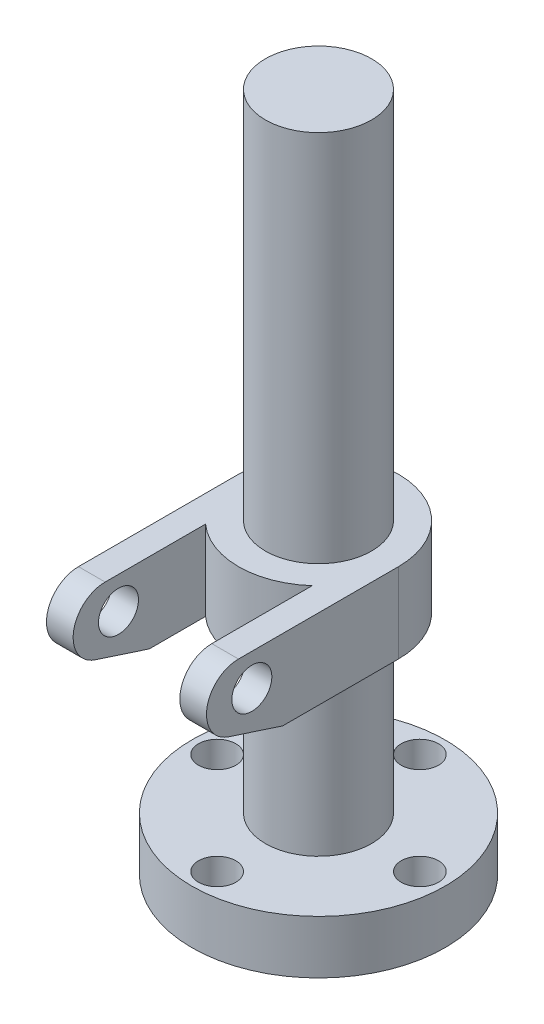
ISO-10303-21;
HEADER;
FILE_DESCRIPTION(('STEP AP214'),'2;1');
FILE_NAME('part.step','',(''),(''),'','','');
FILE_SCHEMA(('AUTOMOTIVE_DESIGN { 1 0 10303 214 1 1 1 1 }'));
ENDSEC;
DATA;
#1=APPLICATION_CONTEXT('core data for automotive mechanical design processes');
#2=APPLICATION_PROTOCOL_DEFINITION('international standard','automotive_design',2000,#1);
#3=PRODUCT_CONTEXT('',#1,'mechanical');
#4=PRODUCT('Part','Part','',(#3));
#5=PRODUCT_RELATED_PRODUCT_CATEGORY('part','',(#4));
#6=PRODUCT_DEFINITION_FORMATION('','',#4);
#7=PRODUCT_DEFINITION_CONTEXT('part definition',#1,'design');
#8=PRODUCT_DEFINITION('design','',#6,#7);
#9=PRODUCT_DEFINITION_SHAPE('','',#8);
#10=(LENGTH_UNIT() NAMED_UNIT(*) SI_UNIT(.MILLI.,.METRE.));
#11=(NAMED_UNIT(*) PLANE_ANGLE_UNIT() SI_UNIT($,.RADIAN.));
#12=(NAMED_UNIT(*) SI_UNIT($,.STERADIAN.) SOLID_ANGLE_UNIT());
#13=UNCERTAINTY_MEASURE_WITH_UNIT(LENGTH_MEASURE(1.E-05),#10,'distance_accuracy_value','');
#14=(GEOMETRIC_REPRESENTATION_CONTEXT(3) GLOBAL_UNCERTAINTY_ASSIGNED_CONTEXT((#13)) GLOBAL_UNIT_ASSIGNED_CONTEXT((#10,
#11,#12)) REPRESENTATION_CONTEXT('',''));
#15=CARTESIAN_POINT('',(0.,0.,0.));
#16=DIRECTION('',(0.,0.,1.));
#17=DIRECTION('',(1.,0.,0.));
#18=AXIS2_PLACEMENT_3D('',#15,#16,#17);
#19=CARTESIAN_POINT('',(0.,307.026159995937,0.));
#20=DIRECTION('',(0.,1.,0.));
#21=DIRECTION('',(0.,0.,1.));
#22=AXIS2_PLACEMENT_3D('',#19,#20,#21);
#23=CYLINDRICAL_SURFACE('',#22,30.);
#24=DIRECTION('',(0.,1.,0.));
#25=VECTOR('',#24,1.);
#26=CARTESIAN_POINT('',(20.,307.026159995937,22.3606797749979));
#27=LINE('',#26,#25);
#28=CARTESIAN_POINT('',(20.,115.,22.3606797749979));
#29=VERTEX_POINT('',#28);
#30=CARTESIAN_POINT('',(20.,85.,22.3606797749979));
#31=VERTEX_POINT('',#30);
#32=EDGE_CURVE('E148',#29,#31,#27,.F.);
#33=ORIENTED_EDGE('',*,*,#32,.F.);
#34=CARTESIAN_POINT('',(0.,115.,0.));
#35=DIRECTION('',(0.,1.,0.));
#36=DIRECTION('',(0.,0.,1.));
#37=AXIS2_PLACEMENT_3D('',#34,#35,#36);
#38=CIRCLE('',#37,30.);
#39=CARTESIAN_POINT('',(-20.,115.,22.3606797749979));
#40=VERTEX_POINT('',#39);
#41=EDGE_CURVE('E160',#40,#29,#38,.T.);
#42=ORIENTED_EDGE('',*,*,#41,.F.);
#43=DIRECTION('',(0.,1.,0.));
#44=VECTOR('',#43,1.);
#45=CARTESIAN_POINT('',(-20.,307.026159995937,22.3606797749979));
#46=LINE('',#45,#44);
#47=CARTESIAN_POINT('',(-20.,85.,22.3606797749979));
#48=VERTEX_POINT('',#47);
#49=EDGE_CURVE('E138',#48,#40,#46,.T.);
#50=ORIENTED_EDGE('',*,*,#49,.F.);
#51=CARTESIAN_POINT('',(0.,85.,0.));
#52=DIRECTION('',(0.,1.,0.));
#53=DIRECTION('',(0.,0.,1.));
#54=AXIS2_PLACEMENT_3D('',#51,#52,#53);
#55=CIRCLE('',#54,30.);
#56=EDGE_CURVE('E164',#48,#31,#55,.T.);
#57=ORIENTED_EDGE('',*,*,#56,.T.);
#58=EDGE_LOOP('',(#33,#42,#50,#57));
#59=FACE_BOUND('',#58,.T.);
#60=ADVANCED_FACE('F36',(#59),#23,.T.);
#61=DIRECTION('',(0.,-1.,0.));
#62=VECTOR('',#61,1.);
#63=CARTESIAN_POINT('',(30.,195.622577482985,0.));
#64=LINE('',#63,#62);
#65=CARTESIAN_POINT('',(30.,115.,0.));
#66=VERTEX_POINT('',#65);
#67=CARTESIAN_POINT('',(30.,85.,0.));
#68=VERTEX_POINT('',#67);
#69=EDGE_CURVE('E199',#66,#68,#64,.T.);
#70=ORIENTED_EDGE('',*,*,#69,.T.);
#71=CARTESIAN_POINT('',(-30.,85.,0.));
#72=VERTEX_POINT('',#71);
#73=EDGE_CURVE('E163',#68,#72,#55,.T.);
#74=ORIENTED_EDGE('',*,*,#73,.T.);
#75=DIRECTION('',(0.,-1.,0.));
#76=VECTOR('',#75,1.);
#77=CARTESIAN_POINT('',(-30.,195.622577482985,0.));
#78=LINE('',#77,#76);
#79=CARTESIAN_POINT('',(-30.,115.,0.));
#80=VERTEX_POINT('',#79);
#81=EDGE_CURVE('E144',#80,#72,#78,.T.);
#82=ORIENTED_EDGE('',*,*,#81,.F.);
#83=EDGE_CURVE('E136',#66,#80,#38,.T.);
#84=ORIENTED_EDGE('',*,*,#83,.F.);
#85=EDGE_LOOP('',(#70,#74,#82,#84));
#86=FACE_BOUND('',#85,.T.);
#87=ADVANCED_FACE('F323',(#86),#23,.T.);
#88=CARTESIAN_POINT('',(19.9,255.,0.));
#89=DIRECTION('',(0.,-1.,0.));
#90=DIRECTION('',(0.,0.,-1.));
#91=AXIS2_PLACEMENT_3D('',#88,#89,#90);
#92=PLANE('',#91);
#93=CARTESIAN_POINT('',(0.,255.,0.));
#94=DIRECTION('',(0.,1.,0.));
#95=DIRECTION('',(0.,0.,1.));
#96=AXIS2_PLACEMENT_3D('',#93,#94,#95);
#97=CIRCLE('',#96,19.9);
#98=CARTESIAN_POINT('',(0.,255.,19.9));
#99=VERTEX_POINT('',#98);
#100=EDGE_CURVE('E142',#99,#99,#97,.T.);
#101=ORIENTED_EDGE('',*,*,#100,.T.);
#102=EDGE_LOOP('',(#101));
#103=FACE_BOUND('',#102,.T.);
#104=ADVANCED_FACE('F38',(#103),#92,.F.);
#105=CARTESIAN_POINT('',(0.,0.,0.));
#106=DIRECTION('',(0.,1.,0.));
#107=DIRECTION('',(0.,0.,1.));
#108=AXIS2_PLACEMENT_3D('',#105,#106,#107);
#109=PLANE('',#108);
#110=CARTESIAN_POINT('',(0.,0.,0.));
#111=DIRECTION('',(0.,-1.,0.));
#112=DIRECTION('',(0.,0.,-1.));
#113=AXIS2_PLACEMENT_3D('',#110,#111,#112);
#114=CIRCLE('',#113,20.);
#115=CARTESIAN_POINT('',(0.,0.,-20.));
#116=VERTEX_POINT('',#115);
#117=EDGE_CURVE('E282',#116,#116,#114,.T.);
#118=ORIENTED_EDGE('',*,*,#117,.F.);
#119=EDGE_LOOP('',(#118));
#120=FACE_BOUND('',#119,.T.);
#121=CARTESIAN_POINT('',(38.,0.,0.));
#122=DIRECTION('',(0.,1.,0.));
#123=DIRECTION('',(0.,0.,1.));
#124=AXIS2_PLACEMENT_3D('',#121,#122,#123);
#125=CIRCLE('',#124,5.00000000000001);
#126=CARTESIAN_POINT('',(38.,0.,5.00000000000001));
#127=VERTEX_POINT('',#126);
#128=EDGE_CURVE('E269',#127,#127,#125,.T.);
#129=ORIENTED_EDGE('',*,*,#128,.T.);
#130=EDGE_LOOP('',(#129));
#131=FACE_BOUND('',#130,.T.);
#132=CARTESIAN_POINT('',(0.,0.,-38.));
#133=DIRECTION('',(0.,1.,0.));
#134=DIRECTION('',(0.,0.,1.));
#135=AXIS2_PLACEMENT_3D('',#132,#133,#134);
#136=CIRCLE('',#135,5.00000000000001);
#137=CARTESIAN_POINT('',(0.,0.,-33.));
#138=VERTEX_POINT('',#137);
#139=EDGE_CURVE('E257',#138,#138,#136,.T.);
#140=ORIENTED_EDGE('',*,*,#139,.T.);
#141=EDGE_LOOP('',(#140));
#142=FACE_BOUND('',#141,.T.);
#143=CARTESIAN_POINT('',(-38.,0.,0.));
#144=DIRECTION('',(0.,1.,0.));
#145=DIRECTION('',(0.,0.,1.));
#146=AXIS2_PLACEMENT_3D('',#143,#144,#145);
#147=CIRCLE('',#146,5.00000000000001);
#148=CARTESIAN_POINT('',(-38.,0.,5.00000000000001));
#149=VERTEX_POINT('',#148);
#150=EDGE_CURVE('E245',#149,#149,#147,.T.);
#151=ORIENTED_EDGE('',*,*,#150,.T.);
#152=EDGE_LOOP('',(#151));
#153=FACE_BOUND('',#152,.T.);
#154=CARTESIAN_POINT('',(0.,0.,38.));
#155=DIRECTION('',(0.,1.,0.));
#156=DIRECTION('',(0.,0.,1.));
#157=AXIS2_PLACEMENT_3D('',#154,#155,#156);
#158=CIRCLE('',#157,5.00000000000001);
#159=CARTESIAN_POINT('',(0.,0.,43.));
#160=VERTEX_POINT('',#159);
#161=EDGE_CURVE('E120',#160,#160,#158,.T.);
#162=ORIENTED_EDGE('',*,*,#161,.T.);
#163=EDGE_LOOP('',(#162));
#164=FACE_BOUND('',#163,.T.);
#165=CARTESIAN_POINT('',(0.,0.,0.));
#166=DIRECTION('',(0.,1.,0.));
#167=DIRECTION('',(0.,0.,1.));
#168=AXIS2_PLACEMENT_3D('',#165,#166,#167);
#169=CIRCLE('',#168,47.5);
#170=CARTESIAN_POINT('',(0.,0.,47.5));
#171=VERTEX_POINT('',#170);
#172=EDGE_CURVE('E176',#171,#171,#169,.T.);
#173=ORIENTED_EDGE('',*,*,#172,.F.);
#174=EDGE_LOOP('',(#173));
#175=FACE_BOUND('',#174,.T.);
#176=ADVANCED_FACE('F297',(#120,#131,#142,#153,#164,#175),#109,.F.);
#177=CARTESIAN_POINT('',(0.,307.026159995937,0.));
#178=DIRECTION('',(0.,1.,0.));
#179=DIRECTION('',(0.,0.,1.));
#180=AXIS2_PLACEMENT_3D('',#177,#178,#179);
#181=CYLINDRICAL_SURFACE('',#180,47.5);
#182=CARTESIAN_POINT('',(0.,20.,0.));
#183=DIRECTION('',(0.,1.,0.));
#184=DIRECTION('',(0.,0.,1.));
#185=AXIS2_PLACEMENT_3D('',#182,#183,#184);
#186=CIRCLE('',#185,47.5);
#187=CARTESIAN_POINT('',(0.,20.,47.5));
#188=VERTEX_POINT('',#187);
#189=EDGE_CURVE('E173',#188,#188,#186,.T.);
#190=ORIENTED_EDGE('',*,*,#189,.F.);
#191=EDGE_LOOP('',(#190));
#192=FACE_BOUND('',#191,.T.);
#193=ORIENTED_EDGE('',*,*,#172,.T.);
#194=EDGE_LOOP('',(#193));
#195=FACE_BOUND('',#194,.T.);
#196=ADVANCED_FACE('F300',(#192,#195),#181,.T.);
#197=CARTESIAN_POINT('',(47.5,20.,0.));
#198=DIRECTION('',(0.,-1.,0.));
#199=DIRECTION('',(0.,0.,-1.));
#200=AXIS2_PLACEMENT_3D('',#197,#198,#199);
#201=PLANE('',#200);
#202=CARTESIAN_POINT('',(38.,20.,0.));
#203=DIRECTION('',(0.,1.,0.));
#204=DIRECTION('',(0.,0.,1.));
#205=AXIS2_PLACEMENT_3D('',#202,#203,#204);
#206=CIRCLE('',#205,7.00000000000001);
#207=CARTESIAN_POINT('',(38.,20.,7.00000000000001));
#208=VERTEX_POINT('',#207);
#209=EDGE_CURVE('E278',#208,#208,#206,.T.);
#210=ORIENTED_EDGE('',*,*,#209,.F.);
#211=EDGE_LOOP('',(#210));
#212=FACE_BOUND('',#211,.T.);
#213=CARTESIAN_POINT('',(0.,20.,-38.));
#214=DIRECTION('',(0.,1.,0.));
#215=DIRECTION('',(0.,0.,1.));
#216=AXIS2_PLACEMENT_3D('',#213,#214,#215);
#217=CIRCLE('',#216,7.00000000000001);
#218=CARTESIAN_POINT('',(0.,20.,-31.));
#219=VERTEX_POINT('',#218);
#220=EDGE_CURVE('E266',#219,#219,#217,.T.);
#221=ORIENTED_EDGE('',*,*,#220,.F.);
#222=EDGE_LOOP('',(#221));
#223=FACE_BOUND('',#222,.T.);
#224=CARTESIAN_POINT('',(-38.,20.,0.));
#225=DIRECTION('',(0.,1.,0.));
#226=DIRECTION('',(0.,0.,1.));
#227=AXIS2_PLACEMENT_3D('',#224,#225,#226);
#228=CIRCLE('',#227,7.00000000000001);
#229=CARTESIAN_POINT('',(-38.,20.,7.00000000000001));
#230=VERTEX_POINT('',#229);
#231=EDGE_CURVE('E254',#230,#230,#228,.T.);
#232=ORIENTED_EDGE('',*,*,#231,.F.);
#233=EDGE_LOOP('',(#232));
#234=FACE_BOUND('',#233,.T.);
#235=CARTESIAN_POINT('',(0.,20.,38.));
#236=DIRECTION('',(0.,1.,0.));
#237=DIRECTION('',(0.,0.,1.));
#238=AXIS2_PLACEMENT_3D('',#235,#236,#237);
#239=CIRCLE('',#238,7.00000000000001);
#240=CARTESIAN_POINT('',(0.,20.,45.));
#241=VERTEX_POINT('',#240);
#242=EDGE_CURVE('E242',#241,#241,#239,.T.);
#243=ORIENTED_EDGE('',*,*,#242,.F.);
#244=EDGE_LOOP('',(#243));
#245=FACE_BOUND('',#244,.T.);
#246=CARTESIAN_POINT('',(0.,20.,0.));
#247=DIRECTION('',(0.,1.,0.));
#248=DIRECTION('',(0.,0.,1.));
#249=AXIS2_PLACEMENT_3D('',#246,#247,#248);
#250=CIRCLE('',#249,19.9);
#251=CARTESIAN_POINT('',(0.,20.,19.9));
#252=VERTEX_POINT('',#251);
#253=EDGE_CURVE('E170',#252,#252,#250,.T.);
#254=ORIENTED_EDGE('',*,*,#253,.F.);
#255=EDGE_LOOP('',(#254));
#256=FACE_BOUND('',#255,.T.);
#257=ORIENTED_EDGE('',*,*,#189,.T.);
#258=EDGE_LOOP('',(#257));
#259=FACE_BOUND('',#258,.T.);
#260=ADVANCED_FACE('F312',(#212,#223,#234,#245,#256,#259),#201,.F.);
#261=CARTESIAN_POINT('',(0.,307.026159995937,0.));
#262=DIRECTION('',(0.,1.,0.));
#263=DIRECTION('',(0.,0.,1.));
#264=AXIS2_PLACEMENT_3D('',#261,#262,#263);
#265=CYLINDRICAL_SURFACE('',#264,19.9);
#266=CARTESIAN_POINT('',(0.,85.,0.));
#267=DIRECTION('',(0.,1.,0.));
#268=DIRECTION('',(0.,0.,1.));
#269=AXIS2_PLACEMENT_3D('',#266,#267,#268);
#270=CIRCLE('',#269,19.9);
#271=CARTESIAN_POINT('',(0.,85.,19.9));
#272=VERTEX_POINT('',#271);
#273=EDGE_CURVE('E167',#272,#272,#270,.T.);
#274=ORIENTED_EDGE('',*,*,#273,.F.);
#275=EDGE_LOOP('',(#274));
#276=FACE_BOUND('',#275,.T.);
#277=ORIENTED_EDGE('',*,*,#253,.T.);
#278=EDGE_LOOP('',(#277));
#279=FACE_BOUND('',#278,.T.);
#280=ADVANCED_FACE('F318',(#276,#279),#265,.T.);
#281=CARTESIAN_POINT('',(19.9,85.,0.));
#282=DIRECTION('',(0.,1.,0.));
#283=DIRECTION('',(0.,0.,1.));
#284=AXIS2_PLACEMENT_3D('',#281,#282,#283);
#285=PLANE('',#284);
#286=DIRECTION('',(0.,0.,-1.));
#287=VECTOR('',#286,1.);
#288=CARTESIAN_POINT('',(30.,85.,0.));
#289=LINE('',#288,#287);
#290=CARTESIAN_POINT('',(30.,85.,43.4422205699365));
#291=VERTEX_POINT('',#290);
#292=EDGE_CURVE('E186',#291,#68,#289,.T.);
#293=ORIENTED_EDGE('',*,*,#292,.F.);
#294=DIRECTION('',(-1.,0.,0.));
#295=VECTOR('',#294,1.);
#296=CARTESIAN_POINT('',(64.,85.,43.4422205699367));
#297=LINE('',#296,#295);
#298=CARTESIAN_POINT('',(20.,85.,43.4422205699367));
#299=VERTEX_POINT('',#298);
#300=EDGE_CURVE('E59',#291,#299,#297,.T.);
#301=ORIENTED_EDGE('',*,*,#300,.T.);
#302=DIRECTION('',(0.,0.,1.));
#303=VECTOR('',#302,1.);
#304=CARTESIAN_POINT('',(20.,85.,80.));
#305=LINE('',#304,#303);
#306=EDGE_CURVE('E197',#31,#299,#305,.T.);
#307=ORIENTED_EDGE('',*,*,#306,.F.);
#308=ORIENTED_EDGE('',*,*,#56,.F.);
#309=DIRECTION('',(0.,0.,-1.));
#310=VECTOR('',#309,1.);
#311=CARTESIAN_POINT('',(-20.,85.,80.));
#312=LINE('',#311,#310);
#313=CARTESIAN_POINT('',(-20.,85.,43.4422205699367));
#314=VERTEX_POINT('',#313);
#315=EDGE_CURVE('E152',#314,#48,#312,.T.);
#316=ORIENTED_EDGE('',*,*,#315,.F.);
#317=CARTESIAN_POINT('',(-30.,85.,43.4422205699367));
#318=VERTEX_POINT('',#317);
#319=EDGE_CURVE('E229',#314,#318,#297,.T.);
#320=ORIENTED_EDGE('',*,*,#319,.T.);
#321=DIRECTION('',(0.,0.,1.));
#322=VECTOR('',#321,1.);
#323=CARTESIAN_POINT('',(-30.,85.,0.));
#324=LINE('',#323,#322);
#325=EDGE_CURVE('E150',#72,#318,#324,.T.);
#326=ORIENTED_EDGE('',*,*,#325,.F.);
#327=ORIENTED_EDGE('',*,*,#73,.F.);
#328=EDGE_LOOP('',(#293,#301,#307,#308,#316,#320,#326,#327));
#329=FACE_BOUND('',#328,.T.);
#330=ORIENTED_EDGE('',*,*,#273,.T.);
#331=EDGE_LOOP('',(#330));
#332=FACE_BOUND('',#331,.T.);
#333=ADVANCED_FACE('F192',(#329,#332),#285,.F.);
#334=CARTESIAN_POINT('',(30.,115.,0.));
#335=DIRECTION('',(0.,-1.,0.));
#336=DIRECTION('',(0.,0.,-1.));
#337=AXIS2_PLACEMENT_3D('',#334,#335,#336);
#338=PLANE('',#337);
#339=DIRECTION('',(0.,0.,-1.));
#340=VECTOR('',#339,1.);
#341=CARTESIAN_POINT('',(-30.,115.,0.));
#342=LINE('',#341,#340);
#343=CARTESIAN_POINT('',(-30.,115.,60.));
#344=VERTEX_POINT('',#343);
#345=EDGE_CURVE('E126',#344,#80,#342,.T.);
#346=ORIENTED_EDGE('',*,*,#345,.F.);
#347=DIRECTION('',(-1.,0.,0.));
#348=VECTOR('',#347,1.);
#349=CARTESIAN_POINT('',(64.,115.,60.));
#350=LINE('',#349,#348);
#351=CARTESIAN_POINT('',(-20.,115.,60.));
#352=VERTEX_POINT('',#351);
#353=EDGE_CURVE('E112',#352,#344,#350,.T.);
#354=ORIENTED_EDGE('',*,*,#353,.F.);
#355=DIRECTION('',(0.,0.,1.));
#356=VECTOR('',#355,1.);
#357=CARTESIAN_POINT('',(-20.,115.,80.));
#358=LINE('',#357,#356);
#359=EDGE_CURVE('E139',#40,#352,#358,.T.);
#360=ORIENTED_EDGE('',*,*,#359,.F.);
#361=ORIENTED_EDGE('',*,*,#41,.T.);
#362=DIRECTION('',(0.,0.,-1.));
#363=VECTOR('',#362,1.);
#364=CARTESIAN_POINT('',(20.,115.,80.));
#365=LINE('',#364,#363);
#366=CARTESIAN_POINT('',(20.,115.,60.));
#367=VERTEX_POINT('',#366);
#368=EDGE_CURVE('E204',#367,#29,#365,.T.);
#369=ORIENTED_EDGE('',*,*,#368,.F.);
#370=CARTESIAN_POINT('',(30.,115.,60.));
#371=VERTEX_POINT('',#370);
#372=EDGE_CURVE('E119',#371,#367,#350,.T.);
#373=ORIENTED_EDGE('',*,*,#372,.F.);
#374=DIRECTION('',(0.,0.,1.));
#375=VECTOR('',#374,1.);
#376=CARTESIAN_POINT('',(30.,115.,0.));
#377=LINE('',#376,#375);
#378=EDGE_CURVE('E203',#66,#371,#377,.T.);
#379=ORIENTED_EDGE('',*,*,#378,.F.);
#380=ORIENTED_EDGE('',*,*,#83,.T.);
#381=EDGE_LOOP('',(#346,#354,#360,#361,#369,#373,#379,#380));
#382=FACE_BOUND('',#381,.T.);
#383=CARTESIAN_POINT('',(0.,115.,0.));
#384=DIRECTION('',(0.,1.,0.));
#385=DIRECTION('',(0.,0.,1.));
#386=AXIS2_PLACEMENT_3D('',#383,#384,#385);
#387=CIRCLE('',#386,19.9);
#388=CARTESIAN_POINT('',(0.,115.,19.9));
#389=VERTEX_POINT('',#388);
#390=EDGE_CURVE('E157',#389,#389,#387,.T.);
#391=ORIENTED_EDGE('',*,*,#390,.F.);
#392=EDGE_LOOP('',(#391));
#393=FACE_BOUND('',#392,.T.);
#394=ADVANCED_FACE('F132',(#382,#393),#338,.F.);
#395=CARTESIAN_POINT('',(0.,307.026159995937,0.));
#396=DIRECTION('',(0.,1.,0.));
#397=DIRECTION('',(0.,0.,1.));
#398=AXIS2_PLACEMENT_3D('',#395,#396,#397);
#399=CYLINDRICAL_SURFACE('',#398,19.9);
#400=ORIENTED_EDGE('',*,*,#100,.F.);
#401=EDGE_LOOP('',(#400));
#402=FACE_BOUND('',#401,.T.);
#403=ORIENTED_EDGE('',*,*,#390,.T.);
#404=EDGE_LOOP('',(#403));
#405=FACE_BOUND('',#404,.T.);
#406=ADVANCED_FACE('F357',(#402,#405),#399,.T.);
#407=CARTESIAN_POINT('',(-20.,195.622577482985,80.));
#408=DIRECTION('',(-1.,0.,0.));
#409=DIRECTION('',(0.,0.,1.));
#410=AXIS2_PLACEMENT_3D('',#407,#408,#409);
#411=PLANE('',#410);
#412=CARTESIAN_POINT('',(-20.,103.,55.));
#413=DIRECTION('',(-1.,0.,0.));
#414=DIRECTION('',(0.,0.,1.));
#415=AXIS2_PLACEMENT_3D('',#412,#413,#414);
#416=CIRCLE('',#415,7.5);
#417=CARTESIAN_POINT('',(-20.,103.,62.5));
#418=VERTEX_POINT('',#417);
#419=EDGE_CURVE('E220',#418,#418,#416,.T.);
#420=ORIENTED_EDGE('',*,*,#419,.T.);
#421=EDGE_LOOP('',(#420));
#422=FACE_BOUND('',#421,.T.);
#423=ORIENTED_EDGE('',*,*,#359,.T.);
#424=CARTESIAN_POINT('',(-20.,103.,60.));
#425=DIRECTION('',(-1.,0.,0.));
#426=DIRECTION('',(0.,0.,1.));
#427=AXIS2_PLACEMENT_3D('',#424,#425,#426);
#428=CIRCLE('',#427,12.);
#429=CARTESIAN_POINT('',(-20.,91.5877363767371,63.7094796121763));
#430=VERTEX_POINT('',#429);
#431=EDGE_CURVE('E115',#352,#430,#428,.F.);
#432=ORIENTED_EDGE('',*,*,#431,.T.);
#433=DIRECTION('',(0.,-0.309123301014688,-0.951021968605238));
#434=VECTOR('',#433,1.);
#435=CARTESIAN_POINT('',(-20.,106.318152953911,109.027803160143));
#436=LINE('',#435,#434);
#437=EDGE_CURVE('E214',#430,#314,#436,.T.);
#438=ORIENTED_EDGE('',*,*,#437,.T.);
#439=ORIENTED_EDGE('',*,*,#315,.T.);
#440=ORIENTED_EDGE('',*,*,#49,.T.);
#441=EDGE_LOOP('',(#423,#432,#438,#439,#440));
#442=FACE_BOUND('',#441,.T.);
#443=ADVANCED_FACE('F363',(#422,#442),#411,.F.);
#444=CARTESIAN_POINT('',(-30.,195.622577482985,0.));
#445=DIRECTION('',(1.,0.,0.));
#446=DIRECTION('',(0.,0.,-1.));
#447=AXIS2_PLACEMENT_3D('',#444,#445,#446);
#448=PLANE('',#447);
#449=CARTESIAN_POINT('',(-30.,103.,55.));
#450=DIRECTION('',(-1.,0.,0.));
#451=DIRECTION('',(0.,0.,1.));
#452=AXIS2_PLACEMENT_3D('',#449,#450,#451);
#453=CIRCLE('',#452,7.5);
#454=CARTESIAN_POINT('',(-30.,103.,62.5));
#455=VERTEX_POINT('',#454);
#456=EDGE_CURVE('E130',#455,#455,#453,.T.);
#457=ORIENTED_EDGE('',*,*,#456,.F.);
#458=EDGE_LOOP('',(#457));
#459=FACE_BOUND('',#458,.T.);
#460=DIRECTION('',(0.,-0.309123301014688,-0.951021968605238));
#461=VECTOR('',#460,1.);
#462=CARTESIAN_POINT('',(-30.,85.,43.4422205699367));
#463=LINE('',#462,#461);
#464=CARTESIAN_POINT('',(-30.,91.5877363767371,63.7094796121763));
#465=VERTEX_POINT('',#464);
#466=EDGE_CURVE('E129',#465,#318,#463,.T.);
#467=ORIENTED_EDGE('',*,*,#466,.F.);
#468=CARTESIAN_POINT('',(-30.,103.,60.));
#469=DIRECTION('',(1.,0.,0.));
#470=DIRECTION('',(0.,0.,1.));
#471=AXIS2_PLACEMENT_3D('',#468,#469,#470);
#472=CIRCLE('',#471,12.);
#473=EDGE_CURVE('E51',#344,#465,#472,.T.);
#474=ORIENTED_EDGE('',*,*,#473,.F.);
#475=ORIENTED_EDGE('',*,*,#345,.T.);
#476=ORIENTED_EDGE('',*,*,#81,.T.);
#477=ORIENTED_EDGE('',*,*,#325,.T.);
#478=EDGE_LOOP('',(#467,#474,#475,#476,#477));
#479=FACE_BOUND('',#478,.T.);
#480=ADVANCED_FACE('F124',(#459,#479),#448,.F.);
#481=CARTESIAN_POINT('',(20.,195.622577482985,80.));
#482=DIRECTION('',(1.,0.,0.));
#483=DIRECTION('',(0.,0.,-1.));
#484=AXIS2_PLACEMENT_3D('',#481,#482,#483);
#485=PLANE('',#484);
#486=CARTESIAN_POINT('',(20.,103.,55.));
#487=DIRECTION('',(1.,0.,0.));
#488=DIRECTION('',(0.,0.,-1.));
#489=AXIS2_PLACEMENT_3D('',#486,#487,#488);
#490=CIRCLE('',#489,7.5);
#491=CARTESIAN_POINT('',(20.,103.,47.5));
#492=VERTEX_POINT('',#491);
#493=EDGE_CURVE('E181',#492,#492,#490,.T.);
#494=ORIENTED_EDGE('',*,*,#493,.T.);
#495=EDGE_LOOP('',(#494));
#496=FACE_BOUND('',#495,.T.);
#497=DIRECTION('',(0.,0.309123301014688,0.951021968605238));
#498=VECTOR('',#497,1.);
#499=CARTESIAN_POINT('',(20.,106.318152953911,109.027803160143));
#500=LINE('',#499,#498);
#501=CARTESIAN_POINT('',(20.,91.5877363767371,63.7094796121762));
#502=VERTEX_POINT('',#501);
#503=EDGE_CURVE('E217',#299,#502,#500,.T.);
#504=ORIENTED_EDGE('',*,*,#503,.T.);
#505=CARTESIAN_POINT('',(20.,103.,60.));
#506=DIRECTION('',(1.,0.,0.));
#507=DIRECTION('',(0.,0.,-1.));
#508=AXIS2_PLACEMENT_3D('',#505,#506,#507);
#509=CIRCLE('',#508,12.);
#510=EDGE_CURVE('E212',#502,#367,#509,.F.);
#511=ORIENTED_EDGE('',*,*,#510,.T.);
#512=ORIENTED_EDGE('',*,*,#368,.T.);
#513=ORIENTED_EDGE('',*,*,#32,.T.);
#514=ORIENTED_EDGE('',*,*,#306,.T.);
#515=EDGE_LOOP('',(#504,#511,#512,#513,#514));
#516=FACE_BOUND('',#515,.T.);
#517=ADVANCED_FACE('F376',(#496,#516),#485,.F.);
#518=CARTESIAN_POINT('',(30.,195.622577482985,0.));
#519=DIRECTION('',(-1.,0.,0.));
#520=DIRECTION('',(0.,0.,1.));
#521=AXIS2_PLACEMENT_3D('',#518,#519,#520);
#522=PLANE('',#521);
#523=CARTESIAN_POINT('',(30.,103.,55.));
#524=DIRECTION('',(-1.,0.,0.));
#525=DIRECTION('',(0.,0.,1.));
#526=AXIS2_PLACEMENT_3D('',#523,#524,#525);
#527=CIRCLE('',#526,7.5);
#528=CARTESIAN_POINT('',(30.,103.,62.5));
#529=VERTEX_POINT('',#528);
#530=EDGE_CURVE('E179',#529,#529,#527,.T.);
#531=ORIENTED_EDGE('',*,*,#530,.T.);
#532=EDGE_LOOP('',(#531));
#533=FACE_BOUND('',#532,.T.);
#534=ORIENTED_EDGE('',*,*,#378,.T.);
#535=CARTESIAN_POINT('',(30.,103.,60.));
#536=DIRECTION('',(-1.,0.,0.));
#537=DIRECTION('',(0.,0.,1.));
#538=AXIS2_PLACEMENT_3D('',#535,#536,#537);
#539=CIRCLE('',#538,12.);
#540=CARTESIAN_POINT('',(30.,91.5877363767371,63.7094796121762));
#541=VERTEX_POINT('',#540);
#542=EDGE_CURVE('E11',#371,#541,#539,.F.);
#543=ORIENTED_EDGE('',*,*,#542,.T.);
#544=DIRECTION('',(0.,-0.309123301014688,-0.951021968605238));
#545=VECTOR('',#544,1.);
#546=CARTESIAN_POINT('',(30.,82.799508932092,36.6723803785605));
#547=LINE('',#546,#545);
#548=EDGE_CURVE('E44',#541,#291,#547,.T.);
#549=ORIENTED_EDGE('',*,*,#548,.T.);
#550=ORIENTED_EDGE('',*,*,#292,.T.);
#551=ORIENTED_EDGE('',*,*,#69,.F.);
#552=EDGE_LOOP('',(#534,#543,#549,#550,#551));
#553=FACE_BOUND('',#552,.T.);
#554=ADVANCED_FACE('F185',(#533,#553),#522,.F.);
#555=CARTESIAN_POINT('',(64.,103.,55.));
#556=DIRECTION('',(-1.,0.,0.));
#557=DIRECTION('',(0.,0.,1.));
#558=AXIS2_PLACEMENT_3D('',#555,#556,#557);
#559=CYLINDRICAL_SURFACE('',#558,7.5);
#560=ORIENTED_EDGE('',*,*,#530,.F.);
#561=EDGE_LOOP('',(#560));
#562=FACE_BOUND('',#561,.T.);
#563=ORIENTED_EDGE('',*,*,#493,.F.);
#564=EDGE_LOOP('',(#563));
#565=FACE_BOUND('',#564,.T.);
#566=ADVANCED_FACE('F391',(#562,#565),#559,.F.);
#567=CARTESIAN_POINT('',(64.,85.,43.4422205699367));
#568=DIRECTION('',(0.,0.951021968605238,-0.309123301014688));
#569=DIRECTION('',(0.,0.309123301014688,0.951021968605238));
#570=AXIS2_PLACEMENT_3D('',#567,#568,#569);
#571=PLANE('',#570);
#572=ORIENTED_EDGE('',*,*,#300,.F.);
#573=ORIENTED_EDGE('',*,*,#548,.F.);
#574=DIRECTION('',(-1.,0.,0.));
#575=VECTOR('',#574,1.);
#576=CARTESIAN_POINT('',(64.,91.5877363767371,63.7094796121762));
#577=LINE('',#576,#575);
#578=EDGE_CURVE('E227',#541,#502,#577,.T.);
#579=ORIENTED_EDGE('',*,*,#578,.T.);
#580=ORIENTED_EDGE('',*,*,#503,.F.);
#581=EDGE_LOOP('',(#572,#573,#579,#580));
#582=FACE_BOUND('',#581,.T.);
#583=ADVANCED_FACE('F399',(#582),#571,.F.);
#584=CARTESIAN_POINT('',(64.,103.,60.));
#585=DIRECTION('',(-1.,0.,0.));
#586=DIRECTION('',(0.,0.,1.));
#587=AXIS2_PLACEMENT_3D('',#584,#585,#586);
#588=CYLINDRICAL_SURFACE('',#587,12.);
#589=ORIENTED_EDGE('',*,*,#578,.F.);
#590=ORIENTED_EDGE('',*,*,#542,.F.);
#591=ORIENTED_EDGE('',*,*,#372,.T.);
#592=ORIENTED_EDGE('',*,*,#510,.F.);
#593=EDGE_LOOP('',(#589,#590,#591,#592));
#594=FACE_BOUND('',#593,.T.);
#595=ADVANCED_FACE('F408',(#594),#588,.T.);
#596=ORIENTED_EDGE('',*,*,#456,.T.);
#597=EDGE_LOOP('',(#596));
#598=FACE_BOUND('',#597,.T.);
#599=ORIENTED_EDGE('',*,*,#419,.F.);
#600=EDGE_LOOP('',(#599));
#601=FACE_BOUND('',#600,.T.);
#602=ADVANCED_FACE('F402',(#598,#601),#559,.F.);
#603=ORIENTED_EDGE('',*,*,#353,.T.);
#604=ORIENTED_EDGE('',*,*,#473,.T.);
#605=EDGE_CURVE('E232',#430,#465,#577,.T.);
#606=ORIENTED_EDGE('',*,*,#605,.F.);
#607=ORIENTED_EDGE('',*,*,#431,.F.);
#608=EDGE_LOOP('',(#603,#604,#606,#607));
#609=FACE_BOUND('',#608,.T.);
#610=ADVANCED_FACE('F113',(#609),#588,.T.);
#611=ORIENTED_EDGE('',*,*,#605,.T.);
#612=ORIENTED_EDGE('',*,*,#466,.T.);
#613=ORIENTED_EDGE('',*,*,#319,.F.);
#614=ORIENTED_EDGE('',*,*,#437,.F.);
#615=EDGE_LOOP('',(#611,#612,#613,#614));
#616=FACE_BOUND('',#615,.T.);
#617=ADVANCED_FACE('F410',(#616),#571,.F.);
#618=CARTESIAN_POINT('',(0.,20.,38.));
#619=DIRECTION('',(0.,1.,0.));
#620=DIRECTION('',(0.,0.,1.));
#621=AXIS2_PLACEMENT_3D('',#618,#619,#620);
#622=CYLINDRICAL_SURFACE('',#621,5.00000000000001);
#623=ORIENTED_EDGE('',*,*,#161,.F.);
#624=EDGE_LOOP('',(#623));
#625=FACE_BOUND('',#624,.T.);
#626=CARTESIAN_POINT('',(0.,9.99999999999999,38.));
#627=DIRECTION('',(0.,1.,0.));
#628=DIRECTION('',(0.,0.,1.));
#629=AXIS2_PLACEMENT_3D('',#626,#627,#628);
#630=CIRCLE('',#629,5.00000000000001);
#631=CARTESIAN_POINT('',(0.,9.99999999999999,43.));
#632=VERTEX_POINT('',#631);
#633=EDGE_CURVE('E236',#632,#632,#630,.T.);
#634=ORIENTED_EDGE('',*,*,#633,.T.);
#635=EDGE_LOOP('',(#634));
#636=FACE_BOUND('',#635,.T.);
#637=ADVANCED_FACE('F434',(#625,#636),#622,.F.);
#638=CARTESIAN_POINT('',(5.00000000000001,9.99999999999999,38.));
#639=DIRECTION('',(0.,-1.,0.));
#640=DIRECTION('',(0.,0.,-1.));
#641=AXIS2_PLACEMENT_3D('',#638,#639,#640);
#642=PLANE('',#641);
#643=ORIENTED_EDGE('',*,*,#633,.F.);
#644=EDGE_LOOP('',(#643));
#645=FACE_BOUND('',#644,.T.);
#646=CARTESIAN_POINT('',(0.,10.,38.));
#647=DIRECTION('',(0.,1.,0.));
#648=DIRECTION('',(0.,0.,1.));
#649=AXIS2_PLACEMENT_3D('',#646,#647,#648);
#650=CIRCLE('',#649,7.00000000000001);
#651=CARTESIAN_POINT('',(0.,10.,45.));
#652=VERTEX_POINT('',#651);
#653=EDGE_CURVE('E239',#652,#652,#650,.T.);
#654=ORIENTED_EDGE('',*,*,#653,.T.);
#655=EDGE_LOOP('',(#654));
#656=FACE_BOUND('',#655,.T.);
#657=ADVANCED_FACE('F441',(#645,#656),#642,.F.);
#658=CARTESIAN_POINT('',(0.,20.,38.));
#659=DIRECTION('',(0.,1.,0.));
#660=DIRECTION('',(0.,0.,1.));
#661=AXIS2_PLACEMENT_3D('',#658,#659,#660);
#662=CYLINDRICAL_SURFACE('',#661,7.00000000000001);
#663=ORIENTED_EDGE('',*,*,#653,.F.);
#664=EDGE_LOOP('',(#663));
#665=FACE_BOUND('',#664,.T.);
#666=ORIENTED_EDGE('',*,*,#242,.T.);
#667=EDGE_LOOP('',(#666));
#668=FACE_BOUND('',#667,.T.);
#669=ADVANCED_FACE('F449',(#665,#668),#662,.F.);
#670=CARTESIAN_POINT('',(-38.,20.,0.));
#671=DIRECTION('',(0.,1.,0.));
#672=DIRECTION('',(0.,0.,1.));
#673=AXIS2_PLACEMENT_3D('',#670,#671,#672);
#674=CYLINDRICAL_SURFACE('',#673,5.00000000000001);
#675=ORIENTED_EDGE('',*,*,#150,.F.);
#676=EDGE_LOOP('',(#675));
#677=FACE_BOUND('',#676,.T.);
#678=CARTESIAN_POINT('',(-38.,9.99999999999999,0.));
#679=DIRECTION('',(0.,1.,0.));
#680=DIRECTION('',(0.,0.,1.));
#681=AXIS2_PLACEMENT_3D('',#678,#679,#680);
#682=CIRCLE('',#681,5.00000000000001);
#683=CARTESIAN_POINT('',(-38.,9.99999999999999,5.00000000000001));
#684=VERTEX_POINT('',#683);
#685=EDGE_CURVE('E248',#684,#684,#682,.T.);
#686=ORIENTED_EDGE('',*,*,#685,.T.);
#687=EDGE_LOOP('',(#686));
#688=FACE_BOUND('',#687,.T.);
#689=ADVANCED_FACE('F457',(#677,#688),#674,.F.);
#690=CARTESIAN_POINT('',(-33.,9.99999999999999,0.));
#691=DIRECTION('',(0.,-1.,0.));
#692=DIRECTION('',(0.,0.,-1.));
#693=AXIS2_PLACEMENT_3D('',#690,#691,#692);
#694=PLANE('',#693);
#695=ORIENTED_EDGE('',*,*,#685,.F.);
#696=EDGE_LOOP('',(#695));
#697=FACE_BOUND('',#696,.T.);
#698=CARTESIAN_POINT('',(-38.,10.,0.));
#699=DIRECTION('',(0.,1.,0.));
#700=DIRECTION('',(0.,0.,1.));
#701=AXIS2_PLACEMENT_3D('',#698,#699,#700);
#702=CIRCLE('',#701,7.00000000000001);
#703=CARTESIAN_POINT('',(-38.,10.,7.00000000000001));
#704=VERTEX_POINT('',#703);
#705=EDGE_CURVE('E251',#704,#704,#702,.T.);
#706=ORIENTED_EDGE('',*,*,#705,.T.);
#707=EDGE_LOOP('',(#706));
#708=FACE_BOUND('',#707,.T.);
#709=ADVANCED_FACE('F465',(#697,#708),#694,.F.);
#710=CARTESIAN_POINT('',(-38.,20.,0.));
#711=DIRECTION('',(0.,1.,0.));
#712=DIRECTION('',(0.,0.,1.));
#713=AXIS2_PLACEMENT_3D('',#710,#711,#712);
#714=CYLINDRICAL_SURFACE('',#713,7.00000000000001);
#715=ORIENTED_EDGE('',*,*,#705,.F.);
#716=EDGE_LOOP('',(#715));
#717=FACE_BOUND('',#716,.T.);
#718=ORIENTED_EDGE('',*,*,#231,.T.);
#719=EDGE_LOOP('',(#718));
#720=FACE_BOUND('',#719,.T.);
#721=ADVANCED_FACE('F473',(#717,#720),#714,.F.);
#722=CARTESIAN_POINT('',(0.,20.,-38.));
#723=DIRECTION('',(0.,1.,0.));
#724=DIRECTION('',(0.,0.,1.));
#725=AXIS2_PLACEMENT_3D('',#722,#723,#724);
#726=CYLINDRICAL_SURFACE('',#725,5.00000000000001);
#727=ORIENTED_EDGE('',*,*,#139,.F.);
#728=EDGE_LOOP('',(#727));
#729=FACE_BOUND('',#728,.T.);
#730=CARTESIAN_POINT('',(0.,9.99999999999999,-38.));
#731=DIRECTION('',(0.,1.,0.));
#732=DIRECTION('',(0.,0.,1.));
#733=AXIS2_PLACEMENT_3D('',#730,#731,#732);
#734=CIRCLE('',#733,5.00000000000001);
#735=CARTESIAN_POINT('',(0.,9.99999999999999,-33.));
#736=VERTEX_POINT('',#735);
#737=EDGE_CURVE('E260',#736,#736,#734,.T.);
#738=ORIENTED_EDGE('',*,*,#737,.T.);
#739=EDGE_LOOP('',(#738));
#740=FACE_BOUND('',#739,.T.);
#741=ADVANCED_FACE('F481',(#729,#740),#726,.F.);
#742=CARTESIAN_POINT('',(5.00000000000001,9.99999999999999,-38.));
#743=DIRECTION('',(0.,-1.,0.));
#744=DIRECTION('',(0.,0.,-1.));
#745=AXIS2_PLACEMENT_3D('',#742,#743,#744);
#746=PLANE('',#745);
#747=ORIENTED_EDGE('',*,*,#737,.F.);
#748=EDGE_LOOP('',(#747));
#749=FACE_BOUND('',#748,.T.);
#750=CARTESIAN_POINT('',(0.,10.,-38.));
#751=DIRECTION('',(0.,1.,0.));
#752=DIRECTION('',(0.,0.,1.));
#753=AXIS2_PLACEMENT_3D('',#750,#751,#752);
#754=CIRCLE('',#753,7.00000000000001);
#755=CARTESIAN_POINT('',(0.,10.,-31.));
#756=VERTEX_POINT('',#755);
#757=EDGE_CURVE('E263',#756,#756,#754,.T.);
#758=ORIENTED_EDGE('',*,*,#757,.T.);
#759=EDGE_LOOP('',(#758));
#760=FACE_BOUND('',#759,.T.);
#761=ADVANCED_FACE('F489',(#749,#760),#746,.F.);
#762=CARTESIAN_POINT('',(0.,20.,-38.));
#763=DIRECTION('',(0.,1.,0.));
#764=DIRECTION('',(0.,0.,1.));
#765=AXIS2_PLACEMENT_3D('',#762,#763,#764);
#766=CYLINDRICAL_SURFACE('',#765,7.00000000000001);
#767=ORIENTED_EDGE('',*,*,#757,.F.);
#768=EDGE_LOOP('',(#767));
#769=FACE_BOUND('',#768,.T.);
#770=ORIENTED_EDGE('',*,*,#220,.T.);
#771=EDGE_LOOP('',(#770));
#772=FACE_BOUND('',#771,.T.);
#773=ADVANCED_FACE('F497',(#769,#772),#766,.F.);
#774=CARTESIAN_POINT('',(38.,20.,0.));
#775=DIRECTION('',(0.,1.,0.));
#776=DIRECTION('',(0.,0.,1.));
#777=AXIS2_PLACEMENT_3D('',#774,#775,#776);
#778=CYLINDRICAL_SURFACE('',#777,5.00000000000001);
#779=ORIENTED_EDGE('',*,*,#128,.F.);
#780=EDGE_LOOP('',(#779));
#781=FACE_BOUND('',#780,.T.);
#782=CARTESIAN_POINT('',(38.,9.99999999999999,0.));
#783=DIRECTION('',(0.,1.,0.));
#784=DIRECTION('',(0.,0.,1.));
#785=AXIS2_PLACEMENT_3D('',#782,#783,#784);
#786=CIRCLE('',#785,5.00000000000001);
#787=CARTESIAN_POINT('',(38.,9.99999999999999,5.00000000000001));
#788=VERTEX_POINT('',#787);
#789=EDGE_CURVE('E272',#788,#788,#786,.T.);
#790=ORIENTED_EDGE('',*,*,#789,.T.);
#791=EDGE_LOOP('',(#790));
#792=FACE_BOUND('',#791,.T.);
#793=ADVANCED_FACE('F505',(#781,#792),#778,.F.);
#794=CARTESIAN_POINT('',(43.,9.99999999999999,0.));
#795=DIRECTION('',(0.,-1.,0.));
#796=DIRECTION('',(0.,0.,-1.));
#797=AXIS2_PLACEMENT_3D('',#794,#795,#796);
#798=PLANE('',#797);
#799=ORIENTED_EDGE('',*,*,#789,.F.);
#800=EDGE_LOOP('',(#799));
#801=FACE_BOUND('',#800,.T.);
#802=CARTESIAN_POINT('',(38.,10.,0.));
#803=DIRECTION('',(0.,1.,0.));
#804=DIRECTION('',(0.,0.,1.));
#805=AXIS2_PLACEMENT_3D('',#802,#803,#804);
#806=CIRCLE('',#805,7.00000000000001);
#807=CARTESIAN_POINT('',(38.,10.,7.00000000000001));
#808=VERTEX_POINT('',#807);
#809=EDGE_CURVE('E275',#808,#808,#806,.T.);
#810=ORIENTED_EDGE('',*,*,#809,.T.);
#811=EDGE_LOOP('',(#810));
#812=FACE_BOUND('',#811,.T.);
#813=ADVANCED_FACE('F513',(#801,#812),#798,.F.);
#814=CARTESIAN_POINT('',(38.,20.,0.));
#815=DIRECTION('',(0.,1.,0.));
#816=DIRECTION('',(0.,0.,1.));
#817=AXIS2_PLACEMENT_3D('',#814,#815,#816);
#818=CYLINDRICAL_SURFACE('',#817,7.00000000000001);
#819=ORIENTED_EDGE('',*,*,#809,.F.);
#820=EDGE_LOOP('',(#819));
#821=FACE_BOUND('',#820,.T.);
#822=ORIENTED_EDGE('',*,*,#209,.T.);
#823=EDGE_LOOP('',(#822));
#824=FACE_BOUND('',#823,.T.);
#825=ADVANCED_FACE('F293',(#821,#824),#818,.F.);
#826=CARTESIAN_POINT('',(0.,15.,0.));
#827=DIRECTION('',(0.,-1.,0.));
#828=DIRECTION('',(0.,0.,-1.));
#829=AXIS2_PLACEMENT_3D('',#826,#827,#828);
#830=CYLINDRICAL_SURFACE('',#829,20.);
#831=CARTESIAN_POINT('',(0.,15.,0.));
#832=DIRECTION('',(0.,-1.,0.));
#833=DIRECTION('',(0.,0.,-1.));
#834=AXIS2_PLACEMENT_3D('',#831,#832,#833);
#835=CIRCLE('',#834,20.);
#836=CARTESIAN_POINT('',(0.,15.,-20.));
#837=VERTEX_POINT('',#836);
#838=EDGE_CURVE('E281',#837,#837,#835,.T.);
#839=ORIENTED_EDGE('',*,*,#838,.F.);
#840=EDGE_LOOP('',(#839));
#841=FACE_BOUND('',#840,.T.);
#842=ORIENTED_EDGE('',*,*,#117,.T.);
#843=EDGE_LOOP('',(#842));
#844=FACE_BOUND('',#843,.T.);
#845=ADVANCED_FACE('F290',(#841,#844),#830,.F.);
#846=CARTESIAN_POINT('',(0.,15.,0.));
#847=DIRECTION('',(0.,-1.,0.));
#848=DIRECTION('',(0.,0.,-1.));
#849=AXIS2_PLACEMENT_3D('',#846,#847,#848);
#850=PLANE('',#849);
#851=ORIENTED_EDGE('',*,*,#838,.T.);
#852=EDGE_LOOP('',(#851));
#853=FACE_BOUND('',#852,.T.);
#854=ADVANCED_FACE('F288',(#853),#850,.T.);
#855=CLOSED_SHELL('',(#60,#87,#104,#176,#196,#260,#280,#333,#394,#406,#443,#480,#517,#554,#566,
#583,#595,#602,#610,#617,#637,#657,#669,#689,#709,#721,#741,#761,#773,#793,#813,#825,#845,#854));
#856=MANIFOLD_SOLID_BREP('B2',#855);
#857=ADVANCED_BREP_SHAPE_REPRESENTATION('',(#18,#856),#14);
#858=SHAPE_DEFINITION_REPRESENTATION(#9,#857);
ENDSEC;
END-ISO-10303-21;
